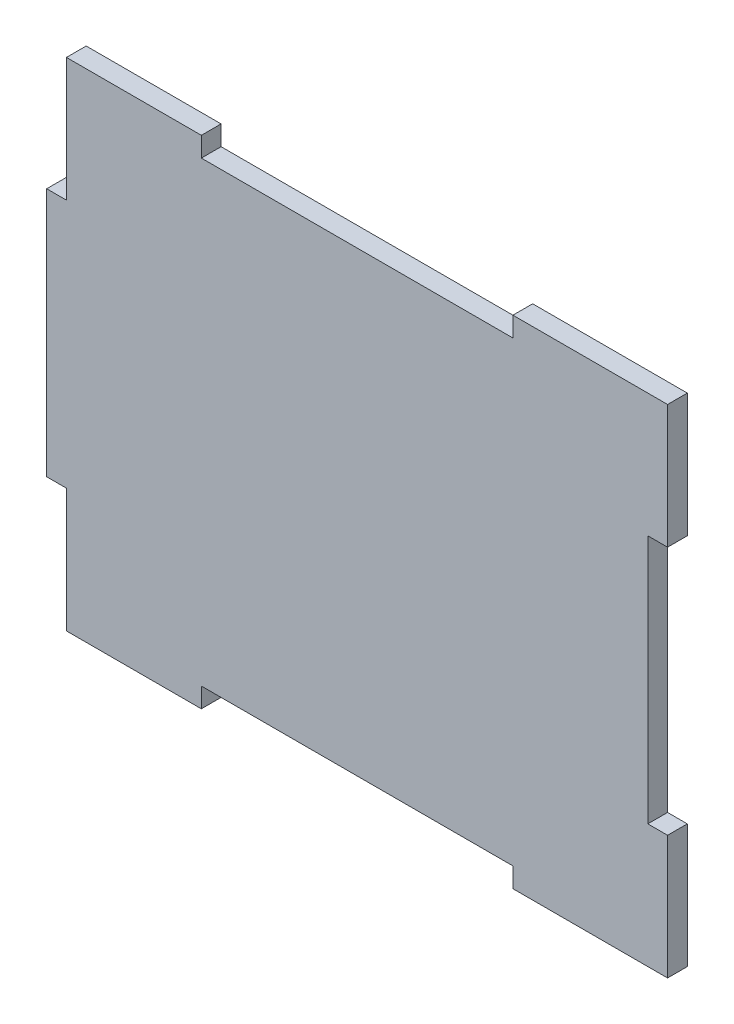
ISO-10303-21;
HEADER;
FILE_DESCRIPTION(('STEP AP214'),'2;1');
FILE_NAME('part.step','',(''),(''),'','','');
FILE_SCHEMA(('AUTOMOTIVE_DESIGN { 1 0 10303 214 1 1 1 1 }'));
ENDSEC;
DATA;
#1=APPLICATION_CONTEXT('core data for automotive mechanical design processes');
#2=APPLICATION_PROTOCOL_DEFINITION('international standard','automotive_design',2000,#1);
#3=PRODUCT_CONTEXT('',#1,'mechanical');
#4=PRODUCT('Part','Part','',(#3));
#5=PRODUCT_RELATED_PRODUCT_CATEGORY('part','',(#4));
#6=PRODUCT_DEFINITION_FORMATION('','',#4);
#7=PRODUCT_DEFINITION_CONTEXT('part definition',#1,'design');
#8=PRODUCT_DEFINITION('design','',#6,#7);
#9=PRODUCT_DEFINITION_SHAPE('','',#8);
#10=(LENGTH_UNIT() NAMED_UNIT(*) SI_UNIT(.MILLI.,.METRE.));
#11=(NAMED_UNIT(*) PLANE_ANGLE_UNIT() SI_UNIT($,.RADIAN.));
#12=(NAMED_UNIT(*) SI_UNIT($,.STERADIAN.) SOLID_ANGLE_UNIT());
#13=UNCERTAINTY_MEASURE_WITH_UNIT(LENGTH_MEASURE(1.E-05),#10,'distance_accuracy_value','');
#14=(GEOMETRIC_REPRESENTATION_CONTEXT(3) GLOBAL_UNCERTAINTY_ASSIGNED_CONTEXT((#13)) GLOBAL_UNIT_ASSIGNED_CONTEXT((#10,
#11,#12)) REPRESENTATION_CONTEXT('',''));
#15=CARTESIAN_POINT('',(0.,0.,0.));
#16=DIRECTION('',(0.,0.,1.));
#17=DIRECTION('',(1.,0.,0.));
#18=AXIS2_PLACEMENT_3D('',#15,#16,#17);
#19=CARTESIAN_POINT('',(50.,-40.,3.18));
#20=DIRECTION('',(0.,1.,0.));
#21=DIRECTION('',(-1.,0.,0.));
#22=AXIS2_PLACEMENT_3D('',#19,#20,#21);
#23=PLANE('',#22);
#24=DIRECTION('',(0.,0.,1.));
#25=VECTOR('',#24,1.);
#26=CARTESIAN_POINT('',(-46.82,-40.,-20.162353533256));
#27=LINE('',#26,#25);
#28=CARTESIAN_POINT('',(-46.82,-40.,0.));
#29=VERTEX_POINT('',#28);
#30=CARTESIAN_POINT('',(-46.82,-40.,3.18));
#31=VERTEX_POINT('',#30);
#32=EDGE_CURVE('E182',#29,#31,#27,.T.);
#33=ORIENTED_EDGE('',*,*,#32,.F.);
#34=DIRECTION('',(1.,0.,0.));
#35=VECTOR('',#34,1.);
#36=CARTESIAN_POINT('',(50.,-40.,0.));
#37=LINE('',#36,#35);
#38=CARTESIAN_POINT('',(-25.09,-40.,0.));
#39=VERTEX_POINT('',#38);
#40=EDGE_CURVE('E304',#29,#39,#37,.T.);
#41=ORIENTED_EDGE('',*,*,#40,.T.);
#42=DIRECTION('',(0.,0.,1.));
#43=VECTOR('',#42,1.);
#44=CARTESIAN_POINT('',(-25.09,-40.,-50.2806602979714));
#45=LINE('',#44,#43);
#46=CARTESIAN_POINT('',(-25.09,-40.,3.18));
#47=VERTEX_POINT('',#46);
#48=EDGE_CURVE('E256',#39,#47,#45,.T.);
#49=ORIENTED_EDGE('',*,*,#48,.T.);
#50=DIRECTION('',(1.,0.,0.));
#51=VECTOR('',#50,1.);
#52=CARTESIAN_POINT('',(50.,-40.,3.18));
#53=LINE('',#52,#51);
#54=EDGE_CURVE('E291',#31,#47,#53,.T.);
#55=ORIENTED_EDGE('',*,*,#54,.F.);
#56=EDGE_LOOP('',(#33,#41,#49,#55));
#57=FACE_BOUND('',#56,.T.);
#58=ADVANCED_FACE('F33',(#57),#23,.F.);
#59=CARTESIAN_POINT('',(0.,0.,3.18));
#60=DIRECTION('',(0.,0.,1.));
#61=DIRECTION('',(1.,0.,0.));
#62=AXIS2_PLACEMENT_3D('',#59,#60,#61);
#63=PLANE('',#62);
#64=DIRECTION('',(0.,-1.,0.));
#65=VECTOR('',#64,1.);
#66=CARTESIAN_POINT('',(-50.,-40.,3.18));
#67=LINE('',#66,#65);
#68=CARTESIAN_POINT('',(-50.,20.09,3.18));
#69=VERTEX_POINT('',#68);
#70=CARTESIAN_POINT('',(-50.,-20.09,3.18));
#71=VERTEX_POINT('',#70);
#72=EDGE_CURVE('E190',#69,#71,#67,.T.);
#73=ORIENTED_EDGE('',*,*,#72,.T.);
#74=DIRECTION('',(1.,0.,0.));
#75=VECTOR('',#74,1.);
#76=CARTESIAN_POINT('',(-46.82,-20.09,3.18));
#77=LINE('',#76,#75);
#78=CARTESIAN_POINT('',(-46.82,-20.09,3.18));
#79=VERTEX_POINT('',#78);
#80=EDGE_CURVE('E48',#71,#79,#77,.T.);
#81=ORIENTED_EDGE('',*,*,#80,.T.);
#82=DIRECTION('',(0.,-1.,0.));
#83=VECTOR('',#82,1.);
#84=CARTESIAN_POINT('',(-46.82,-40.,3.18));
#85=LINE('',#84,#83);
#86=EDGE_CURVE('E179',#79,#31,#85,.T.);
#87=ORIENTED_EDGE('',*,*,#86,.T.);
#88=ORIENTED_EDGE('',*,*,#54,.T.);
#89=DIRECTION('',(0.,1.,0.));
#90=VECTOR('',#89,1.);
#91=CARTESIAN_POINT('',(-25.09,-40.,3.18));
#92=LINE('',#91,#90);
#93=CARTESIAN_POINT('',(-25.09,-36.82,3.18));
#94=VERTEX_POINT('',#93);
#95=EDGE_CURVE('E236',#47,#94,#92,.T.);
#96=ORIENTED_EDGE('',*,*,#95,.T.);
#97=DIRECTION('',(1.,0.,0.));
#98=VECTOR('',#97,1.);
#99=CARTESIAN_POINT('',(-25.09,-36.82,3.18));
#100=LINE('',#99,#98);
#101=CARTESIAN_POINT('',(25.09,-36.82,3.18));
#102=VERTEX_POINT('',#101);
#103=EDGE_CURVE('E253',#94,#102,#100,.T.);
#104=ORIENTED_EDGE('',*,*,#103,.T.);
#105=DIRECTION('',(0.,-1.,0.));
#106=VECTOR('',#105,1.);
#107=CARTESIAN_POINT('',(25.09,-40.,3.18));
#108=LINE('',#107,#106);
#109=CARTESIAN_POINT('',(25.09,-40.,3.18));
#110=VERTEX_POINT('',#109);
#111=EDGE_CURVE('E250',#102,#110,#108,.T.);
#112=ORIENTED_EDGE('',*,*,#111,.T.);
#113=CARTESIAN_POINT('',(50.,-40.,3.18));
#114=VERTEX_POINT('',#113);
#115=EDGE_CURVE('E289',#110,#114,#53,.T.);
#116=ORIENTED_EDGE('',*,*,#115,.T.);
#117=DIRECTION('',(0.,1.,0.));
#118=VECTOR('',#117,1.);
#119=CARTESIAN_POINT('',(50.,-40.,3.18));
#120=LINE('',#119,#118);
#121=CARTESIAN_POINT('',(50.,-20.09,3.18));
#122=VERTEX_POINT('',#121);
#123=EDGE_CURVE('E294',#114,#122,#120,.T.);
#124=ORIENTED_EDGE('',*,*,#123,.T.);
#125=DIRECTION('',(1.,0.,0.));
#126=VECTOR('',#125,1.);
#127=CARTESIAN_POINT('',(50.,-20.09,3.18));
#128=LINE('',#127,#126);
#129=CARTESIAN_POINT('',(46.82,-20.09,3.18));
#130=VERTEX_POINT('',#129);
#131=EDGE_CURVE('E225',#130,#122,#128,.T.);
#132=ORIENTED_EDGE('',*,*,#131,.F.);
#133=DIRECTION('',(0.,-1.,0.));
#134=VECTOR('',#133,1.);
#135=CARTESIAN_POINT('',(46.82,20.09,3.18));
#136=LINE('',#135,#134);
#137=CARTESIAN_POINT('',(46.82,20.09,3.18));
#138=VERTEX_POINT('',#137);
#139=EDGE_CURVE('E222',#138,#130,#136,.T.);
#140=ORIENTED_EDGE('',*,*,#139,.F.);
#141=DIRECTION('',(-1.,0.,0.));
#142=VECTOR('',#141,1.);
#143=CARTESIAN_POINT('',(50.,20.09,3.18));
#144=LINE('',#143,#142);
#145=CARTESIAN_POINT('',(50.,20.09,3.18));
#146=VERTEX_POINT('',#145);
#147=EDGE_CURVE('E202',#146,#138,#144,.T.);
#148=ORIENTED_EDGE('',*,*,#147,.F.);
#149=CARTESIAN_POINT('',(50.,40.,3.18));
#150=VERTEX_POINT('',#149);
#151=EDGE_CURVE('E293',#146,#150,#120,.T.);
#152=ORIENTED_EDGE('',*,*,#151,.T.);
#153=DIRECTION('',(-1.,0.,0.));
#154=VECTOR('',#153,1.);
#155=CARTESIAN_POINT('',(50.,40.,3.18));
#156=LINE('',#155,#154);
#157=CARTESIAN_POINT('',(25.09,40.,3.18));
#158=VERTEX_POINT('',#157);
#159=EDGE_CURVE('E298',#150,#158,#156,.T.);
#160=ORIENTED_EDGE('',*,*,#159,.T.);
#161=DIRECTION('',(0.,1.,0.));
#162=VECTOR('',#161,1.);
#163=CARTESIAN_POINT('',(25.09,40.,3.18));
#164=LINE('',#163,#162);
#165=CARTESIAN_POINT('',(25.09,36.82,3.18));
#166=VERTEX_POINT('',#165);
#167=EDGE_CURVE('E276',#166,#158,#164,.T.);
#168=ORIENTED_EDGE('',*,*,#167,.F.);
#169=DIRECTION('',(1.,0.,0.));
#170=VECTOR('',#169,1.);
#171=CARTESIAN_POINT('',(-25.09,36.82,3.18));
#172=LINE('',#171,#170);
#173=CARTESIAN_POINT('',(-25.09,36.82,3.18));
#174=VERTEX_POINT('',#173);
#175=EDGE_CURVE('E273',#174,#166,#172,.T.);
#176=ORIENTED_EDGE('',*,*,#175,.F.);
#177=DIRECTION('',(0.,-1.,0.));
#178=VECTOR('',#177,1.);
#179=CARTESIAN_POINT('',(-25.09,40.,3.18));
#180=LINE('',#179,#178);
#181=CARTESIAN_POINT('',(-25.09,40.,3.18));
#182=VERTEX_POINT('',#181);
#183=EDGE_CURVE('E247',#182,#174,#180,.T.);
#184=ORIENTED_EDGE('',*,*,#183,.F.);
#185=CARTESIAN_POINT('',(-46.82,40.,3.18));
#186=VERTEX_POINT('',#185);
#187=EDGE_CURVE('E297',#182,#186,#156,.T.);
#188=ORIENTED_EDGE('',*,*,#187,.T.);
#189=DIRECTION('',(0.,1.,0.));
#190=VECTOR('',#189,1.);
#191=CARTESIAN_POINT('',(-46.82,40.,3.18));
#192=LINE('',#191,#190);
#193=CARTESIAN_POINT('',(-46.82,20.09,3.18));
#194=VERTEX_POINT('',#193);
#195=EDGE_CURVE('E203',#194,#186,#192,.T.);
#196=ORIENTED_EDGE('',*,*,#195,.F.);
#197=DIRECTION('',(1.,0.,0.));
#198=VECTOR('',#197,1.);
#199=CARTESIAN_POINT('',(-46.82,20.09,3.18));
#200=LINE('',#199,#198);
#201=EDGE_CURVE('E205',#69,#194,#200,.T.);
#202=ORIENTED_EDGE('',*,*,#201,.F.);
#203=EDGE_LOOP('',(#73,#81,#87,#88,#96,#104,#112,#116,#124,#132,#140,#148,#152,#160,#168,#176,
#184,#188,#196,#202));
#204=FACE_BOUND('',#203,.T.);
#205=ADVANCED_FACE('F187',(#204),#63,.T.);
#206=CARTESIAN_POINT('',(0.,0.,0.));
#207=DIRECTION('',(0.,0.,1.));
#208=DIRECTION('',(1.,0.,0.));
#209=AXIS2_PLACEMENT_3D('',#206,#207,#208);
#210=PLANE('',#209);
#211=DIRECTION('',(-1.,0.,0.));
#212=VECTOR('',#211,1.);
#213=CARTESIAN_POINT('',(-46.82,-20.09,0.));
#214=LINE('',#213,#212);
#215=CARTESIAN_POINT('',(-46.82,-20.09,0.));
#216=VERTEX_POINT('',#215);
#217=CARTESIAN_POINT('',(-50.,-20.09,0.));
#218=VERTEX_POINT('',#217);
#219=EDGE_CURVE('E173',#216,#218,#214,.T.);
#220=ORIENTED_EDGE('',*,*,#219,.T.);
#221=DIRECTION('',(0.,-1.,0.));
#222=VECTOR('',#221,1.);
#223=CARTESIAN_POINT('',(-50.,-40.,0.));
#224=LINE('',#223,#222);
#225=CARTESIAN_POINT('',(-50.,20.09,0.));
#226=VERTEX_POINT('',#225);
#227=EDGE_CURVE('E287',#226,#218,#224,.T.);
#228=ORIENTED_EDGE('',*,*,#227,.F.);
#229=DIRECTION('',(-1.,0.,0.));
#230=VECTOR('',#229,1.);
#231=CARTESIAN_POINT('',(-46.82,20.09,0.));
#232=LINE('',#231,#230);
#233=CARTESIAN_POINT('',(-46.82,20.09,0.));
#234=VERTEX_POINT('',#233);
#235=EDGE_CURVE('E56',#234,#226,#232,.T.);
#236=ORIENTED_EDGE('',*,*,#235,.F.);
#237=DIRECTION('',(0.,-1.,0.));
#238=VECTOR('',#237,1.);
#239=CARTESIAN_POINT('',(-46.82,40.,0.));
#240=LINE('',#239,#238);
#241=CARTESIAN_POINT('',(-46.82,40.,0.));
#242=VERTEX_POINT('',#241);
#243=EDGE_CURVE('E199',#242,#234,#240,.T.);
#244=ORIENTED_EDGE('',*,*,#243,.F.);
#245=DIRECTION('',(-1.,0.,0.));
#246=VECTOR('',#245,1.);
#247=CARTESIAN_POINT('',(50.,40.,0.));
#248=LINE('',#247,#246);
#249=CARTESIAN_POINT('',(-25.09,40.,0.));
#250=VERTEX_POINT('',#249);
#251=EDGE_CURVE('E310',#250,#242,#248,.T.);
#252=ORIENTED_EDGE('',*,*,#251,.F.);
#253=DIRECTION('',(0.,1.,0.));
#254=VECTOR('',#253,1.);
#255=CARTESIAN_POINT('',(-25.09,40.,0.));
#256=LINE('',#255,#254);
#257=CARTESIAN_POINT('',(-25.09,36.82,0.));
#258=VERTEX_POINT('',#257);
#259=EDGE_CURVE('E267',#258,#250,#256,.T.);
#260=ORIENTED_EDGE('',*,*,#259,.F.);
#261=DIRECTION('',(-1.,0.,0.));
#262=VECTOR('',#261,1.);
#263=CARTESIAN_POINT('',(-25.09,36.82,0.));
#264=LINE('',#263,#262);
#265=CARTESIAN_POINT('',(25.09,36.82,0.));
#266=VERTEX_POINT('',#265);
#267=EDGE_CURVE('E270',#266,#258,#264,.T.);
#268=ORIENTED_EDGE('',*,*,#267,.F.);
#269=DIRECTION('',(0.,-1.,0.));
#270=VECTOR('',#269,1.);
#271=CARTESIAN_POINT('',(25.09,40.,0.));
#272=LINE('',#271,#270);
#273=CARTESIAN_POINT('',(25.09,40.,0.));
#274=VERTEX_POINT('',#273);
#275=EDGE_CURVE('E264',#274,#266,#272,.T.);
#276=ORIENTED_EDGE('',*,*,#275,.F.);
#277=CARTESIAN_POINT('',(50.,40.,0.));
#278=VERTEX_POINT('',#277);
#279=EDGE_CURVE('E290',#278,#274,#248,.T.);
#280=ORIENTED_EDGE('',*,*,#279,.F.);
#281=DIRECTION('',(0.,1.,0.));
#282=VECTOR('',#281,1.);
#283=CARTESIAN_POINT('',(50.,-40.,0.));
#284=LINE('',#283,#282);
#285=CARTESIAN_POINT('',(50.,20.09,0.));
#286=VERTEX_POINT('',#285);
#287=EDGE_CURVE('E306',#286,#278,#284,.T.);
#288=ORIENTED_EDGE('',*,*,#287,.F.);
#289=DIRECTION('',(1.,0.,0.));
#290=VECTOR('',#289,1.);
#291=CARTESIAN_POINT('',(50.,20.09,0.));
#292=LINE('',#291,#290);
#293=CARTESIAN_POINT('',(46.82,20.09,0.));
#294=VERTEX_POINT('',#293);
#295=EDGE_CURVE('E219',#294,#286,#292,.T.);
#296=ORIENTED_EDGE('',*,*,#295,.F.);
#297=DIRECTION('',(0.,1.,0.));
#298=VECTOR('',#297,1.);
#299=CARTESIAN_POINT('',(46.82,20.09,0.));
#300=LINE('',#299,#298);
#301=CARTESIAN_POINT('',(46.82,-20.09,0.));
#302=VERTEX_POINT('',#301);
#303=EDGE_CURVE('E214',#302,#294,#300,.T.);
#304=ORIENTED_EDGE('',*,*,#303,.F.);
#305=DIRECTION('',(-1.,0.,0.));
#306=VECTOR('',#305,1.);
#307=CARTESIAN_POINT('',(50.,-20.09,0.));
#308=LINE('',#307,#306);
#309=CARTESIAN_POINT('',(50.,-20.09,0.));
#310=VERTEX_POINT('',#309);
#311=EDGE_CURVE('E216',#310,#302,#308,.T.);
#312=ORIENTED_EDGE('',*,*,#311,.F.);
#313=CARTESIAN_POINT('',(50.,-40.,0.));
#314=VERTEX_POINT('',#313);
#315=EDGE_CURVE('E307',#314,#310,#284,.T.);
#316=ORIENTED_EDGE('',*,*,#315,.F.);
#317=CARTESIAN_POINT('',(25.09,-40.,0.));
#318=VERTEX_POINT('',#317);
#319=EDGE_CURVE('E303',#318,#314,#37,.T.);
#320=ORIENTED_EDGE('',*,*,#319,.F.);
#321=DIRECTION('',(0.,1.,0.));
#322=VECTOR('',#321,1.);
#323=CARTESIAN_POINT('',(25.09,-40.,0.));
#324=LINE('',#323,#322);
#325=CARTESIAN_POINT('',(25.09,-36.82,0.));
#326=VERTEX_POINT('',#325);
#327=EDGE_CURVE('E237',#318,#326,#324,.T.);
#328=ORIENTED_EDGE('',*,*,#327,.T.);
#329=DIRECTION('',(-1.,0.,0.));
#330=VECTOR('',#329,1.);
#331=CARTESIAN_POINT('',(-25.09,-36.82,0.));
#332=LINE('',#331,#330);
#333=CARTESIAN_POINT('',(-25.09,-36.82,0.));
#334=VERTEX_POINT('',#333);
#335=EDGE_CURVE('E240',#326,#334,#332,.T.);
#336=ORIENTED_EDGE('',*,*,#335,.T.);
#337=DIRECTION('',(0.,-1.,0.));
#338=VECTOR('',#337,1.);
#339=CARTESIAN_POINT('',(-25.09,-40.,0.));
#340=LINE('',#339,#338);
#341=EDGE_CURVE('E244',#334,#39,#340,.T.);
#342=ORIENTED_EDGE('',*,*,#341,.T.);
#343=ORIENTED_EDGE('',*,*,#40,.F.);
#344=DIRECTION('',(0.,1.,0.));
#345=VECTOR('',#344,1.);
#346=CARTESIAN_POINT('',(-46.82,-40.,0.));
#347=LINE('',#346,#345);
#348=EDGE_CURVE('E197',#29,#216,#347,.T.);
#349=ORIENTED_EDGE('',*,*,#348,.T.);
#350=EDGE_LOOP('',(#220,#228,#236,#244,#252,#260,#268,#276,#280,#288,#296,#304,#312,#316,#320,
#328,#336,#342,#343,#349));
#351=FACE_BOUND('',#350,.T.);
#352=ADVANCED_FACE('F323',(#351),#210,.F.);
#353=CARTESIAN_POINT('',(-50.,-40.,3.18));
#354=DIRECTION('',(1.,0.,0.));
#355=DIRECTION('',(0.,0.,-1.));
#356=AXIS2_PLACEMENT_3D('',#353,#354,#355);
#357=PLANE('',#356);
#358=DIRECTION('',(0.,0.,1.));
#359=VECTOR('',#358,1.);
#360=CARTESIAN_POINT('',(-50.,-20.09,-20.162353533256));
#361=LINE('',#360,#359);
#362=EDGE_CURVE('E176',#218,#71,#361,.T.);
#363=ORIENTED_EDGE('',*,*,#362,.T.);
#364=ORIENTED_EDGE('',*,*,#72,.F.);
#365=DIRECTION('',(0.,0.,1.));
#366=VECTOR('',#365,1.);
#367=CARTESIAN_POINT('',(-50.,20.09,-20.162353533256));
#368=LINE('',#367,#366);
#369=EDGE_CURVE('E210',#226,#69,#368,.T.);
#370=ORIENTED_EDGE('',*,*,#369,.F.);
#371=ORIENTED_EDGE('',*,*,#227,.T.);
#372=EDGE_LOOP('',(#363,#364,#370,#371));
#373=FACE_BOUND('',#372,.T.);
#374=ADVANCED_FACE('F35',(#373),#357,.F.);
#375=CARTESIAN_POINT('',(50.,-40.,3.18));
#376=DIRECTION('',(-1.,0.,0.));
#377=DIRECTION('',(0.,0.,1.));
#378=AXIS2_PLACEMENT_3D('',#375,#376,#377);
#379=PLANE('',#378);
#380=ORIENTED_EDGE('',*,*,#315,.T.);
#381=DIRECTION('',(0.,0.,1.));
#382=VECTOR('',#381,1.);
#383=CARTESIAN_POINT('',(50.,-20.09,-40.3056422849209));
#384=LINE('',#383,#382);
#385=EDGE_CURVE('E217',#310,#122,#384,.T.);
#386=ORIENTED_EDGE('',*,*,#385,.T.);
#387=ORIENTED_EDGE('',*,*,#123,.F.);
#388=DIRECTION('',(0.,0.,-1.));
#389=VECTOR('',#388,1.);
#390=CARTESIAN_POINT('',(50.,-40.,3.18));
#391=LINE('',#390,#389);
#392=EDGE_CURVE('E11',#114,#314,#391,.T.);
#393=ORIENTED_EDGE('',*,*,#392,.T.);
#394=EDGE_LOOP('',(#380,#386,#387,#393));
#395=FACE_BOUND('',#394,.T.);
#396=ADVANCED_FACE('F349',(#395),#379,.F.);
#397=DIRECTION('',(0.,0.,1.));
#398=VECTOR('',#397,1.);
#399=CARTESIAN_POINT('',(25.09,-40.,-50.2806602979714));
#400=LINE('',#399,#398);
#401=EDGE_CURVE('E260',#318,#110,#400,.T.);
#402=ORIENTED_EDGE('',*,*,#401,.F.);
#403=ORIENTED_EDGE('',*,*,#319,.T.);
#404=ORIENTED_EDGE('',*,*,#392,.F.);
#405=ORIENTED_EDGE('',*,*,#115,.F.);
#406=EDGE_LOOP('',(#402,#403,#404,#405));
#407=FACE_BOUND('',#406,.T.);
#408=ADVANCED_FACE('F355',(#407),#23,.F.);
#409=CARTESIAN_POINT('',(50.,40.,3.18));
#410=DIRECTION('',(0.,-1.,0.));
#411=DIRECTION('',(1.,0.,0.));
#412=AXIS2_PLACEMENT_3D('',#409,#410,#411);
#413=PLANE('',#412);
#414=ORIENTED_EDGE('',*,*,#251,.T.);
#415=DIRECTION('',(0.,0.,1.));
#416=VECTOR('',#415,1.);
#417=CARTESIAN_POINT('',(-46.82,40.,-20.162353533256));
#418=LINE('',#417,#416);
#419=EDGE_CURVE('E208',#242,#186,#418,.T.);
#420=ORIENTED_EDGE('',*,*,#419,.T.);
#421=ORIENTED_EDGE('',*,*,#187,.F.);
#422=DIRECTION('',(0.,0.,1.));
#423=VECTOR('',#422,1.);
#424=CARTESIAN_POINT('',(-25.09,40.,-50.2806602979714));
#425=LINE('',#424,#423);
#426=EDGE_CURVE('E268',#250,#182,#425,.T.);
#427=ORIENTED_EDGE('',*,*,#426,.F.);
#428=EDGE_LOOP('',(#414,#420,#421,#427));
#429=FACE_BOUND('',#428,.T.);
#430=ADVANCED_FACE('F377',(#429),#413,.F.);
#431=ORIENTED_EDGE('',*,*,#151,.F.);
#432=DIRECTION('',(0.,0.,1.));
#433=VECTOR('',#432,1.);
#434=CARTESIAN_POINT('',(50.,20.09,-40.3056422849209));
#435=LINE('',#434,#433);
#436=EDGE_CURVE('E227',#286,#146,#435,.T.);
#437=ORIENTED_EDGE('',*,*,#436,.F.);
#438=ORIENTED_EDGE('',*,*,#287,.T.);
#439=DIRECTION('',(0.,0.,-1.));
#440=VECTOR('',#439,1.);
#441=CARTESIAN_POINT('',(50.,40.,3.18));
#442=LINE('',#441,#440);
#443=EDGE_CURVE('E41',#150,#278,#442,.T.);
#444=ORIENTED_EDGE('',*,*,#443,.F.);
#445=EDGE_LOOP('',(#431,#437,#438,#444));
#446=FACE_BOUND('',#445,.T.);
#447=ADVANCED_FACE('F334',(#446),#379,.F.);
#448=ORIENTED_EDGE('',*,*,#279,.T.);
#449=DIRECTION('',(0.,0.,1.));
#450=VECTOR('',#449,1.);
#451=CARTESIAN_POINT('',(25.09,40.,-50.2806602979714));
#452=LINE('',#451,#450);
#453=EDGE_CURVE('E280',#274,#158,#452,.T.);
#454=ORIENTED_EDGE('',*,*,#453,.T.);
#455=ORIENTED_EDGE('',*,*,#159,.F.);
#456=ORIENTED_EDGE('',*,*,#443,.T.);
#457=EDGE_LOOP('',(#448,#454,#455,#456));
#458=FACE_BOUND('',#457,.T.);
#459=ADVANCED_FACE('F317',(#458),#413,.F.);
#460=CARTESIAN_POINT('',(-25.09,40.,-50.2806602979714));
#461=DIRECTION('',(-1.,0.,0.));
#462=DIRECTION('',(0.,0.,1.));
#463=AXIS2_PLACEMENT_3D('',#460,#461,#462);
#464=PLANE('',#463);
#465=ORIENTED_EDGE('',*,*,#259,.T.);
#466=ORIENTED_EDGE('',*,*,#426,.T.);
#467=ORIENTED_EDGE('',*,*,#183,.T.);
#468=DIRECTION('',(0.,0.,1.));
#469=VECTOR('',#468,1.);
#470=CARTESIAN_POINT('',(-25.09,36.82,-50.2806602979714));
#471=LINE('',#470,#469);
#472=EDGE_CURVE('E278',#258,#174,#471,.T.);
#473=ORIENTED_EDGE('',*,*,#472,.F.);
#474=EDGE_LOOP('',(#465,#466,#467,#473));
#475=FACE_BOUND('',#474,.T.);
#476=ADVANCED_FACE('F392',(#475),#464,.F.);
#477=CARTESIAN_POINT('',(25.09,40.,-50.2806602979714));
#478=DIRECTION('',(1.,0.,0.));
#479=DIRECTION('',(0.,0.,-1.));
#480=AXIS2_PLACEMENT_3D('',#477,#478,#479);
#481=PLANE('',#480);
#482=ORIENTED_EDGE('',*,*,#275,.T.);
#483=DIRECTION('',(0.,0.,1.));
#484=VECTOR('',#483,1.);
#485=CARTESIAN_POINT('',(25.09,36.82,-50.2806602979714));
#486=LINE('',#485,#484);
#487=EDGE_CURVE('E283',#266,#166,#486,.T.);
#488=ORIENTED_EDGE('',*,*,#487,.T.);
#489=ORIENTED_EDGE('',*,*,#167,.T.);
#490=ORIENTED_EDGE('',*,*,#453,.F.);
#491=EDGE_LOOP('',(#482,#488,#489,#490));
#492=FACE_BOUND('',#491,.T.);
#493=ADVANCED_FACE('F328',(#492),#481,.F.);
#494=CARTESIAN_POINT('',(-25.09,36.82,-50.2806602979714));
#495=DIRECTION('',(0.,-1.,0.));
#496=DIRECTION('',(0.,0.,-1.));
#497=AXIS2_PLACEMENT_3D('',#494,#495,#496);
#498=PLANE('',#497);
#499=ORIENTED_EDGE('',*,*,#267,.T.);
#500=ORIENTED_EDGE('',*,*,#472,.T.);
#501=ORIENTED_EDGE('',*,*,#175,.T.);
#502=ORIENTED_EDGE('',*,*,#487,.F.);
#503=EDGE_LOOP('',(#499,#500,#501,#502));
#504=FACE_BOUND('',#503,.T.);
#505=ADVANCED_FACE('F401',(#504),#498,.F.);
#506=CARTESIAN_POINT('',(25.09,-40.,-50.2806602979714));
#507=DIRECTION('',(-1.,0.,0.));
#508=DIRECTION('',(0.,0.,1.));
#509=AXIS2_PLACEMENT_3D('',#506,#507,#508);
#510=PLANE('',#509);
#511=ORIENTED_EDGE('',*,*,#401,.T.);
#512=ORIENTED_EDGE('',*,*,#111,.F.);
#513=DIRECTION('',(0.,0.,1.));
#514=VECTOR('',#513,1.);
#515=CARTESIAN_POINT('',(25.09,-36.82,-50.2806602979714));
#516=LINE('',#515,#514);
#517=EDGE_CURVE('E258',#326,#102,#516,.T.);
#518=ORIENTED_EDGE('',*,*,#517,.F.);
#519=ORIENTED_EDGE('',*,*,#327,.F.);
#520=EDGE_LOOP('',(#511,#512,#518,#519));
#521=FACE_BOUND('',#520,.T.);
#522=ADVANCED_FACE('F359',(#521),#510,.T.);
#523=CARTESIAN_POINT('',(-25.09,-36.82,-50.2806602979714));
#524=DIRECTION('',(0.,-1.,0.));
#525=DIRECTION('',(0.,0.,-1.));
#526=AXIS2_PLACEMENT_3D('',#523,#524,#525);
#527=PLANE('',#526);
#528=ORIENTED_EDGE('',*,*,#517,.T.);
#529=ORIENTED_EDGE('',*,*,#103,.F.);
#530=DIRECTION('',(0.,0.,1.));
#531=VECTOR('',#530,1.);
#532=CARTESIAN_POINT('',(-25.09,-36.82,-50.2806602979714));
#533=LINE('',#532,#531);
#534=EDGE_CURVE('E241',#334,#94,#533,.T.);
#535=ORIENTED_EDGE('',*,*,#534,.F.);
#536=ORIENTED_EDGE('',*,*,#335,.F.);
#537=EDGE_LOOP('',(#528,#529,#535,#536));
#538=FACE_BOUND('',#537,.T.);
#539=ADVANCED_FACE('F362',(#538),#527,.T.);
#540=CARTESIAN_POINT('',(-25.09,-40.,-50.2806602979714));
#541=DIRECTION('',(1.,0.,0.));
#542=DIRECTION('',(0.,0.,-1.));
#543=AXIS2_PLACEMENT_3D('',#540,#541,#542);
#544=PLANE('',#543);
#545=ORIENTED_EDGE('',*,*,#534,.T.);
#546=ORIENTED_EDGE('',*,*,#95,.F.);
#547=ORIENTED_EDGE('',*,*,#48,.F.);
#548=ORIENTED_EDGE('',*,*,#341,.F.);
#549=EDGE_LOOP('',(#545,#546,#547,#548));
#550=FACE_BOUND('',#549,.T.);
#551=ADVANCED_FACE('F366',(#550),#544,.T.);
#552=CARTESIAN_POINT('',(50.,-20.09,-40.3056422849209));
#553=DIRECTION('',(0.,-1.,0.));
#554=DIRECTION('',(0.,0.,-1.));
#555=AXIS2_PLACEMENT_3D('',#552,#553,#554);
#556=PLANE('',#555);
#557=ORIENTED_EDGE('',*,*,#311,.T.);
#558=DIRECTION('',(0.,0.,1.));
#559=VECTOR('',#558,1.);
#560=CARTESIAN_POINT('',(46.82,-20.09,-40.3056422849209));
#561=LINE('',#560,#559);
#562=EDGE_CURVE('E230',#302,#130,#561,.T.);
#563=ORIENTED_EDGE('',*,*,#562,.T.);
#564=ORIENTED_EDGE('',*,*,#131,.T.);
#565=ORIENTED_EDGE('',*,*,#385,.F.);
#566=EDGE_LOOP('',(#557,#563,#564,#565));
#567=FACE_BOUND('',#566,.T.);
#568=ADVANCED_FACE('F346',(#567),#556,.F.);
#569=CARTESIAN_POINT('',(46.82,20.09,-40.3056422849209));
#570=DIRECTION('',(-1.,0.,0.));
#571=DIRECTION('',(0.,0.,1.));
#572=AXIS2_PLACEMENT_3D('',#569,#570,#571);
#573=PLANE('',#572);
#574=ORIENTED_EDGE('',*,*,#303,.T.);
#575=DIRECTION('',(0.,0.,1.));
#576=VECTOR('',#575,1.);
#577=CARTESIAN_POINT('',(46.82,20.09,-40.3056422849209));
#578=LINE('',#577,#576);
#579=EDGE_CURVE('E232',#294,#138,#578,.T.);
#580=ORIENTED_EDGE('',*,*,#579,.T.);
#581=ORIENTED_EDGE('',*,*,#139,.T.);
#582=ORIENTED_EDGE('',*,*,#562,.F.);
#583=EDGE_LOOP('',(#574,#580,#581,#582));
#584=FACE_BOUND('',#583,.T.);
#585=ADVANCED_FACE('F343',(#584),#573,.F.);
#586=CARTESIAN_POINT('',(50.,20.09,-40.3056422849209));
#587=DIRECTION('',(0.,1.,0.));
#588=DIRECTION('',(0.,0.,1.));
#589=AXIS2_PLACEMENT_3D('',#586,#587,#588);
#590=PLANE('',#589);
#591=ORIENTED_EDGE('',*,*,#295,.T.);
#592=ORIENTED_EDGE('',*,*,#436,.T.);
#593=ORIENTED_EDGE('',*,*,#147,.T.);
#594=ORIENTED_EDGE('',*,*,#579,.F.);
#595=EDGE_LOOP('',(#591,#592,#593,#594));
#596=FACE_BOUND('',#595,.T.);
#597=ADVANCED_FACE('F336',(#596),#590,.F.);
#598=CARTESIAN_POINT('',(-46.82,40.,-20.162353533256));
#599=DIRECTION('',(1.,0.,0.));
#600=DIRECTION('',(0.,0.,-1.));
#601=AXIS2_PLACEMENT_3D('',#598,#599,#600);
#602=PLANE('',#601);
#603=ORIENTED_EDGE('',*,*,#243,.T.);
#604=DIRECTION('',(0.,0.,1.));
#605=VECTOR('',#604,1.);
#606=CARTESIAN_POINT('',(-46.82,20.09,-20.162353533256));
#607=LINE('',#606,#605);
#608=EDGE_CURVE('E200',#234,#194,#607,.T.);
#609=ORIENTED_EDGE('',*,*,#608,.T.);
#610=ORIENTED_EDGE('',*,*,#195,.T.);
#611=ORIENTED_EDGE('',*,*,#419,.F.);
#612=EDGE_LOOP('',(#603,#609,#610,#611));
#613=FACE_BOUND('',#612,.T.);
#614=ADVANCED_FACE('F415',(#613),#602,.F.);
#615=CARTESIAN_POINT('',(-46.82,20.09,-20.162353533256));
#616=DIRECTION('',(0.,-1.,0.));
#617=DIRECTION('',(0.,0.,-1.));
#618=AXIS2_PLACEMENT_3D('',#615,#616,#617);
#619=PLANE('',#618);
#620=ORIENTED_EDGE('',*,*,#235,.T.);
#621=ORIENTED_EDGE('',*,*,#369,.T.);
#622=ORIENTED_EDGE('',*,*,#201,.T.);
#623=ORIENTED_EDGE('',*,*,#608,.F.);
#624=EDGE_LOOP('',(#620,#621,#622,#623));
#625=FACE_BOUND('',#624,.T.);
#626=ADVANCED_FACE('F422',(#625),#619,.F.);
#627=CARTESIAN_POINT('',(-46.82,-20.09,-20.162353533256));
#628=DIRECTION('',(0.,-1.,0.));
#629=DIRECTION('',(0.,0.,-1.));
#630=AXIS2_PLACEMENT_3D('',#627,#628,#629);
#631=PLANE('',#630);
#632=DIRECTION('',(0.,0.,1.));
#633=VECTOR('',#632,1.);
#634=CARTESIAN_POINT('',(-46.82,-20.09,-20.162353533256));
#635=LINE('',#634,#633);
#636=EDGE_CURVE('E169',#216,#79,#635,.T.);
#637=ORIENTED_EDGE('',*,*,#636,.T.);
#638=ORIENTED_EDGE('',*,*,#80,.F.);
#639=ORIENTED_EDGE('',*,*,#362,.F.);
#640=ORIENTED_EDGE('',*,*,#219,.F.);
#641=EDGE_LOOP('',(#637,#638,#639,#640));
#642=FACE_BOUND('',#641,.T.);
#643=ADVANCED_FACE('F171',(#642),#631,.T.);
#644=CARTESIAN_POINT('',(-46.82,-40.,-20.162353533256));
#645=DIRECTION('',(-1.,0.,0.));
#646=DIRECTION('',(0.,0.,1.));
#647=AXIS2_PLACEMENT_3D('',#644,#645,#646);
#648=PLANE('',#647);
#649=ORIENTED_EDGE('',*,*,#32,.T.);
#650=ORIENTED_EDGE('',*,*,#86,.F.);
#651=ORIENTED_EDGE('',*,*,#636,.F.);
#652=ORIENTED_EDGE('',*,*,#348,.F.);
#653=EDGE_LOOP('',(#649,#650,#651,#652));
#654=FACE_BOUND('',#653,.T.);
#655=ADVANCED_FACE('F180',(#654),#648,.T.);
#656=CLOSED_SHELL('',(#58,#205,#352,#374,#396,#408,#430,#447,#459,#476,#493,#505,#522,#539,#551,
#568,#585,#597,#614,#626,#643,#655));
#657=MANIFOLD_SOLID_BREP('B2',#656);
#658=ADVANCED_BREP_SHAPE_REPRESENTATION('',(#18,#657),#14);
#659=SHAPE_DEFINITION_REPRESENTATION(#9,#658);
ENDSEC;
END-ISO-10303-21;
